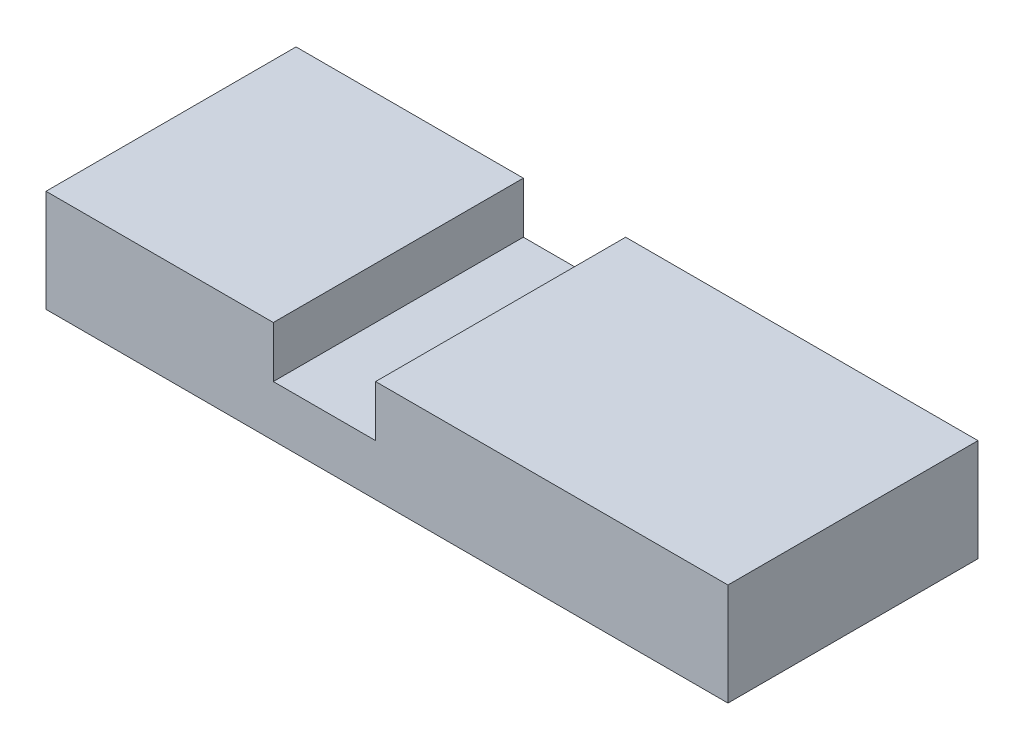
ISO-10303-21;
HEADER;
FILE_DESCRIPTION(('STEP AP214'),'2;1');
FILE_NAME('part.step','',(''),(''),'','','');
FILE_SCHEMA(('AUTOMOTIVE_DESIGN { 1 0 10303 214 1 1 1 1 }'));
ENDSEC;
DATA;
#1=APPLICATION_CONTEXT('core data for automotive mechanical design processes');
#2=APPLICATION_PROTOCOL_DEFINITION('international standard','automotive_design',2000,#1);
#3=PRODUCT_CONTEXT('',#1,'mechanical');
#4=PRODUCT('Part','Part','',(#3));
#5=PRODUCT_RELATED_PRODUCT_CATEGORY('part','',(#4));
#6=PRODUCT_DEFINITION_FORMATION('','',#4);
#7=PRODUCT_DEFINITION_CONTEXT('part definition',#1,'design');
#8=PRODUCT_DEFINITION('design','',#6,#7);
#9=PRODUCT_DEFINITION_SHAPE('','',#8);
#10=(LENGTH_UNIT() NAMED_UNIT(*) SI_UNIT(.MILLI.,.METRE.));
#11=(NAMED_UNIT(*) PLANE_ANGLE_UNIT() SI_UNIT($,.RADIAN.));
#12=(NAMED_UNIT(*) SI_UNIT($,.STERADIAN.) SOLID_ANGLE_UNIT());
#13=UNCERTAINTY_MEASURE_WITH_UNIT(LENGTH_MEASURE(1.E-05),#10,'distance_accuracy_value','');
#14=(GEOMETRIC_REPRESENTATION_CONTEXT(3) GLOBAL_UNCERTAINTY_ASSIGNED_CONTEXT((#13)) GLOBAL_UNIT_ASSIGNED_CONTEXT((#10,
#11,#12)) REPRESENTATION_CONTEXT('',''));
#15=CARTESIAN_POINT('',(0.,0.,0.));
#16=DIRECTION('',(0.,0.,1.));
#17=DIRECTION('',(1.,0.,0.));
#18=AXIS2_PLACEMENT_3D('',#15,#16,#17);
#19=CARTESIAN_POINT('',(0.,18.,-44.));
#20=DIRECTION('',(0.,-1.,0.));
#21=DIRECTION('',(0.,0.,-1.));
#22=AXIS2_PLACEMENT_3D('',#19,#20,#21);
#23=PLANE('',#22);
#24=DIRECTION('',(-1.,0.,0.));
#25=VECTOR('',#24,1.);
#26=CARTESIAN_POINT('',(-120.,18.,-44.));
#27=LINE('',#26,#25);
#28=CARTESIAN_POINT('',(0.,18.,-44.));
#29=VERTEX_POINT('',#28);
#30=CARTESIAN_POINT('',(-62.,18.,-44.));
#31=VERTEX_POINT('',#30);
#32=EDGE_CURVE('E86',#29,#31,#27,.T.);
#33=ORIENTED_EDGE('',*,*,#32,.T.);
#34=DIRECTION('',(0.,0.,1.));
#35=VECTOR('',#34,1.);
#36=CARTESIAN_POINT('',(-62.,18.,-44.001));
#37=LINE('',#36,#35);
#38=CARTESIAN_POINT('',(-62.,18.,0.));
#39=VERTEX_POINT('',#38);
#40=EDGE_CURVE('E161',#31,#39,#37,.T.);
#41=ORIENTED_EDGE('',*,*,#40,.T.);
#42=DIRECTION('',(1.,0.,0.));
#43=VECTOR('',#42,1.);
#44=CARTESIAN_POINT('',(0.,18.,0.));
#45=LINE('',#44,#43);
#46=CARTESIAN_POINT('',(0.,18.,0.));
#47=VERTEX_POINT('',#46);
#48=EDGE_CURVE('E57',#39,#47,#45,.T.);
#49=ORIENTED_EDGE('',*,*,#48,.T.);
#50=DIRECTION('',(0.,0.,-1.));
#51=VECTOR('',#50,1.);
#52=CARTESIAN_POINT('',(0.,18.,0.));
#53=LINE('',#52,#51);
#54=EDGE_CURVE('E144',#47,#29,#53,.T.);
#55=ORIENTED_EDGE('',*,*,#54,.T.);
#56=EDGE_LOOP('',(#33,#41,#49,#55));
#57=FACE_BOUND('',#56,.T.);
#58=ADVANCED_FACE('F33',(#57),#23,.F.);
#59=CARTESIAN_POINT('',(0.,18.,0.));
#60=DIRECTION('',(-1.,0.,0.));
#61=DIRECTION('',(0.,0.,1.));
#62=AXIS2_PLACEMENT_3D('',#59,#60,#61);
#63=PLANE('',#62);
#64=DIRECTION('',(0.,0.,-1.));
#65=VECTOR('',#64,1.);
#66=CARTESIAN_POINT('',(0.,0.,0.));
#67=LINE('',#66,#65);
#68=CARTESIAN_POINT('',(0.,0.,0.));
#69=VERTEX_POINT('',#68);
#70=CARTESIAN_POINT('',(0.,0.,-44.));
#71=VERTEX_POINT('',#70);
#72=EDGE_CURVE('E137',#69,#71,#67,.T.);
#73=ORIENTED_EDGE('',*,*,#72,.T.);
#74=DIRECTION('',(0.,-1.,0.));
#75=VECTOR('',#74,1.);
#76=CARTESIAN_POINT('',(0.,18.,-44.));
#77=LINE('',#76,#75);
#78=EDGE_CURVE('E11',#29,#71,#77,.T.);
#79=ORIENTED_EDGE('',*,*,#78,.F.);
#80=ORIENTED_EDGE('',*,*,#54,.F.);
#81=DIRECTION('',(0.,-1.,0.));
#82=VECTOR('',#81,1.);
#83=CARTESIAN_POINT('',(0.,18.,0.));
#84=LINE('',#83,#82);
#85=EDGE_CURVE('E130',#47,#69,#84,.T.);
#86=ORIENTED_EDGE('',*,*,#85,.T.);
#87=EDGE_LOOP('',(#73,#79,#80,#86));
#88=FACE_BOUND('',#87,.T.);
#89=ADVANCED_FACE('F35',(#88),#63,.F.);
#90=CARTESIAN_POINT('',(-120.,18.,-44.));
#91=DIRECTION('',(0.,0.,1.));
#92=DIRECTION('',(1.,0.,0.));
#93=AXIS2_PLACEMENT_3D('',#90,#91,#92);
#94=PLANE('',#93);
#95=DIRECTION('',(-1.,0.,0.));
#96=VECTOR('',#95,1.);
#97=CARTESIAN_POINT('',(-80.,9.,-44.));
#98=LINE('',#97,#96);
#99=CARTESIAN_POINT('',(-62.,9.,-44.));
#100=VERTEX_POINT('',#99);
#101=CARTESIAN_POINT('',(-80.,9.,-44.));
#102=VERTEX_POINT('',#101);
#103=EDGE_CURVE('E171',#100,#102,#98,.T.);
#104=ORIENTED_EDGE('',*,*,#103,.F.);
#105=DIRECTION('',(0.,-1.,0.));
#106=VECTOR('',#105,1.);
#107=CARTESIAN_POINT('',(-62.,9.,-44.));
#108=LINE('',#107,#106);
#109=EDGE_CURVE('E124',#31,#100,#108,.T.);
#110=ORIENTED_EDGE('',*,*,#109,.F.);
#111=ORIENTED_EDGE('',*,*,#32,.F.);
#112=ORIENTED_EDGE('',*,*,#78,.T.);
#113=DIRECTION('',(-1.,0.,0.));
#114=VECTOR('',#113,1.);
#115=CARTESIAN_POINT('',(-120.,0.,-44.));
#116=LINE('',#115,#114);
#117=CARTESIAN_POINT('',(-120.,0.,-44.));
#118=VERTEX_POINT('',#117);
#119=EDGE_CURVE('E140',#71,#118,#116,.T.);
#120=ORIENTED_EDGE('',*,*,#119,.T.);
#121=DIRECTION('',(0.,-1.,0.));
#122=VECTOR('',#121,1.);
#123=CARTESIAN_POINT('',(-120.,18.,-44.));
#124=LINE('',#123,#122);
#125=CARTESIAN_POINT('',(-120.,18.,-44.));
#126=VERTEX_POINT('',#125);
#127=EDGE_CURVE('E41',#126,#118,#124,.T.);
#128=ORIENTED_EDGE('',*,*,#127,.F.);
#129=CARTESIAN_POINT('',(-80.,18.,-44.));
#130=VERTEX_POINT('',#129);
#131=EDGE_CURVE('E167',#130,#126,#27,.T.);
#132=ORIENTED_EDGE('',*,*,#131,.F.);
#133=DIRECTION('',(0.,1.,0.));
#134=VECTOR('',#133,1.);
#135=CARTESIAN_POINT('',(-80.,18.,-44.));
#136=LINE('',#135,#134);
#137=EDGE_CURVE('E48',#102,#130,#136,.T.);
#138=ORIENTED_EDGE('',*,*,#137,.F.);
#139=EDGE_LOOP('',(#104,#110,#111,#112,#120,#128,#132,#138));
#140=FACE_BOUND('',#139,.T.);
#141=ADVANCED_FACE('F169',(#140),#94,.F.);
#142=CARTESIAN_POINT('',(-120.,18.,0.));
#143=DIRECTION('',(1.,0.,0.));
#144=DIRECTION('',(0.,0.,-1.));
#145=AXIS2_PLACEMENT_3D('',#142,#143,#144);
#146=PLANE('',#145);
#147=DIRECTION('',(0.,0.,1.));
#148=VECTOR('',#147,1.);
#149=CARTESIAN_POINT('',(-120.,0.,0.));
#150=LINE('',#149,#148);
#151=CARTESIAN_POINT('',(-120.,0.,0.));
#152=VERTEX_POINT('',#151);
#153=EDGE_CURVE('E142',#118,#152,#150,.T.);
#154=ORIENTED_EDGE('',*,*,#153,.T.);
#155=DIRECTION('',(0.,-1.,0.));
#156=VECTOR('',#155,1.);
#157=CARTESIAN_POINT('',(-120.,18.,0.));
#158=LINE('',#157,#156);
#159=CARTESIAN_POINT('',(-120.,18.,0.));
#160=VERTEX_POINT('',#159);
#161=EDGE_CURVE('E132',#160,#152,#158,.T.);
#162=ORIENTED_EDGE('',*,*,#161,.F.);
#163=DIRECTION('',(0.,0.,1.));
#164=VECTOR('',#163,1.);
#165=CARTESIAN_POINT('',(-120.,18.,0.));
#166=LINE('',#165,#164);
#167=EDGE_CURVE('E128',#126,#160,#166,.T.);
#168=ORIENTED_EDGE('',*,*,#167,.F.);
#169=ORIENTED_EDGE('',*,*,#127,.T.);
#170=EDGE_LOOP('',(#154,#162,#168,#169));
#171=FACE_BOUND('',#170,.T.);
#172=ADVANCED_FACE('F150',(#171),#146,.F.);
#173=CARTESIAN_POINT('',(0.,18.,0.));
#174=DIRECTION('',(0.,0.,-1.));
#175=DIRECTION('',(-1.,0.,0.));
#176=AXIS2_PLACEMENT_3D('',#173,#174,#175);
#177=PLANE('',#176);
#178=ORIENTED_EDGE('',*,*,#48,.F.);
#179=DIRECTION('',(0.,1.,0.));
#180=VECTOR('',#179,1.);
#181=CARTESIAN_POINT('',(-62.,9.,0.));
#182=LINE('',#181,#180);
#183=CARTESIAN_POINT('',(-62.,9.,0.));
#184=VERTEX_POINT('',#183);
#185=EDGE_CURVE('E116',#184,#39,#182,.T.);
#186=ORIENTED_EDGE('',*,*,#185,.F.);
#187=DIRECTION('',(1.,0.,0.));
#188=VECTOR('',#187,1.);
#189=CARTESIAN_POINT('',(-80.,9.,0.));
#190=LINE('',#189,#188);
#191=CARTESIAN_POINT('',(-80.,9.,0.));
#192=VERTEX_POINT('',#191);
#193=EDGE_CURVE('E123',#192,#184,#190,.T.);
#194=ORIENTED_EDGE('',*,*,#193,.F.);
#195=DIRECTION('',(0.,-1.,0.));
#196=VECTOR('',#195,1.);
#197=CARTESIAN_POINT('',(-80.,18.,0.));
#198=LINE('',#197,#196);
#199=CARTESIAN_POINT('',(-80.,18.,0.));
#200=VERTEX_POINT('',#199);
#201=EDGE_CURVE('E110',#200,#192,#198,.T.);
#202=ORIENTED_EDGE('',*,*,#201,.F.);
#203=EDGE_CURVE('E120',#160,#200,#45,.T.);
#204=ORIENTED_EDGE('',*,*,#203,.F.);
#205=ORIENTED_EDGE('',*,*,#161,.T.);
#206=DIRECTION('',(1.,0.,0.));
#207=VECTOR('',#206,1.);
#208=CARTESIAN_POINT('',(0.,0.,0.));
#209=LINE('',#208,#207);
#210=EDGE_CURVE('E79',#152,#69,#209,.T.);
#211=ORIENTED_EDGE('',*,*,#210,.T.);
#212=ORIENTED_EDGE('',*,*,#85,.F.);
#213=EDGE_LOOP('',(#178,#186,#194,#202,#204,#205,#211,#212));
#214=FACE_BOUND('',#213,.T.);
#215=ADVANCED_FACE('F119',(#214),#177,.F.);
#216=ORIENTED_EDGE('',*,*,#203,.T.);
#217=DIRECTION('',(0.,0.,1.));
#218=VECTOR('',#217,1.);
#219=CARTESIAN_POINT('',(-80.,18.,-44.001));
#220=LINE('',#219,#218);
#221=EDGE_CURVE('E107',#130,#200,#220,.T.);
#222=ORIENTED_EDGE('',*,*,#221,.F.);
#223=ORIENTED_EDGE('',*,*,#131,.T.);
#224=ORIENTED_EDGE('',*,*,#167,.T.);
#225=EDGE_LOOP('',(#216,#222,#223,#224));
#226=FACE_BOUND('',#225,.T.);
#227=ADVANCED_FACE('F126',(#226),#23,.F.);
#228=CARTESIAN_POINT('',(0.,0.,-44.));
#229=DIRECTION('',(0.,-1.,0.));
#230=DIRECTION('',(0.,0.,-1.));
#231=AXIS2_PLACEMENT_3D('',#228,#229,#230);
#232=PLANE('',#231);
#233=ORIENTED_EDGE('',*,*,#72,.F.);
#234=ORIENTED_EDGE('',*,*,#210,.F.);
#235=ORIENTED_EDGE('',*,*,#153,.F.);
#236=ORIENTED_EDGE('',*,*,#119,.F.);
#237=EDGE_LOOP('',(#233,#234,#235,#236));
#238=FACE_BOUND('',#237,.T.);
#239=ADVANCED_FACE('F153',(#238),#232,.T.);
#240=CARTESIAN_POINT('',(-62.,9.,-44.001));
#241=DIRECTION('',(1.,0.,0.));
#242=DIRECTION('',(0.,0.,-1.));
#243=AXIS2_PLACEMENT_3D('',#240,#241,#242);
#244=PLANE('',#243);
#245=ORIENTED_EDGE('',*,*,#109,.T.);
#246=DIRECTION('',(0.,0.,1.));
#247=VECTOR('',#246,1.);
#248=CARTESIAN_POINT('',(-62.,9.,-44.001));
#249=LINE('',#248,#247);
#250=EDGE_CURVE('E163',#100,#184,#249,.T.);
#251=ORIENTED_EDGE('',*,*,#250,.T.);
#252=ORIENTED_EDGE('',*,*,#185,.T.);
#253=ORIENTED_EDGE('',*,*,#40,.F.);
#254=EDGE_LOOP('',(#245,#251,#252,#253));
#255=FACE_BOUND('',#254,.T.);
#256=ADVANCED_FACE('F176',(#255),#244,.F.);
#257=CARTESIAN_POINT('',(-80.,9.,-44.001));
#258=DIRECTION('',(0.,-1.,0.));
#259=DIRECTION('',(1.,0.,0.));
#260=AXIS2_PLACEMENT_3D('',#257,#258,#259);
#261=PLANE('',#260);
#262=ORIENTED_EDGE('',*,*,#103,.T.);
#263=DIRECTION('',(0.,0.,1.));
#264=VECTOR('',#263,1.);
#265=CARTESIAN_POINT('',(-80.,9.,-44.001));
#266=LINE('',#265,#264);
#267=EDGE_CURVE('E115',#102,#192,#266,.T.);
#268=ORIENTED_EDGE('',*,*,#267,.T.);
#269=ORIENTED_EDGE('',*,*,#193,.T.);
#270=ORIENTED_EDGE('',*,*,#250,.F.);
#271=EDGE_LOOP('',(#262,#268,#269,#270));
#272=FACE_BOUND('',#271,.T.);
#273=ADVANCED_FACE('F227',(#272),#261,.F.);
#274=CARTESIAN_POINT('',(-80.,18.,-44.001));
#275=DIRECTION('',(-1.,0.,0.));
#276=DIRECTION('',(0.,0.,1.));
#277=AXIS2_PLACEMENT_3D('',#274,#275,#276);
#278=PLANE('',#277);
#279=ORIENTED_EDGE('',*,*,#137,.T.);
#280=ORIENTED_EDGE('',*,*,#221,.T.);
#281=ORIENTED_EDGE('',*,*,#201,.T.);
#282=ORIENTED_EDGE('',*,*,#267,.F.);
#283=EDGE_LOOP('',(#279,#280,#281,#282));
#284=FACE_BOUND('',#283,.T.);
#285=ADVANCED_FACE('F109',(#284),#278,.F.);
#286=CLOSED_SHELL('',(#58,#89,#141,#172,#215,#227,#239,#256,#273,#285));
#287=MANIFOLD_SOLID_BREP('B2',#286);
#288=ADVANCED_BREP_SHAPE_REPRESENTATION('',(#18,#287),#14);
#289=SHAPE_DEFINITION_REPRESENTATION(#9,#288);
ENDSEC;
END-ISO-10303-21;
